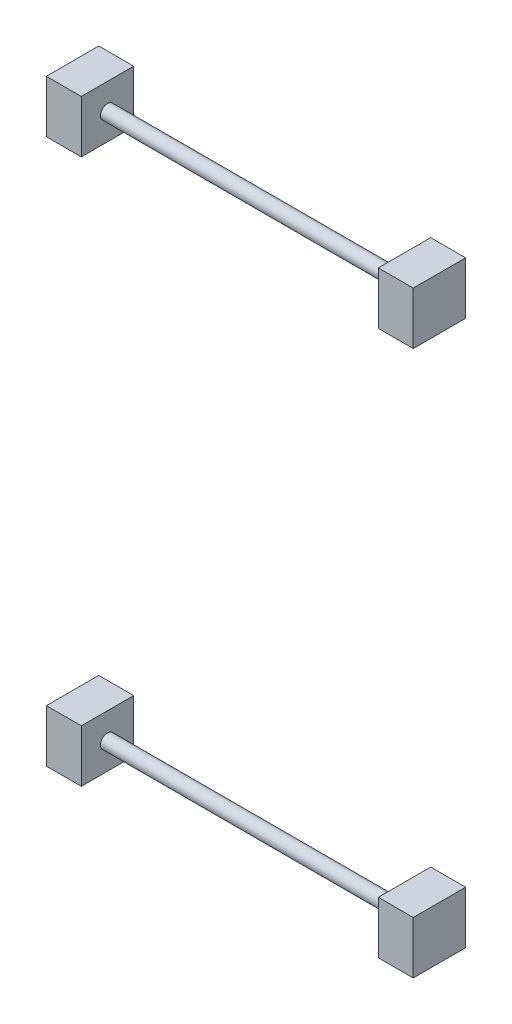
ISO-10303-21;
HEADER;
FILE_DESCRIPTION(('STEP AP214'),'2;1');
FILE_NAME('part.step','',(''),(''),'','','');
FILE_SCHEMA(('AUTOMOTIVE_DESIGN { 1 0 10303 214 1 1 1 1 }'));
ENDSEC;
DATA;
#1=APPLICATION_CONTEXT('core data for automotive mechanical design processes');
#2=APPLICATION_PROTOCOL_DEFINITION('international standard','automotive_design',2000,#1);
#3=PRODUCT_CONTEXT('',#1,'mechanical');
#4=PRODUCT('Part','Part','',(#3));
#5=PRODUCT_RELATED_PRODUCT_CATEGORY('part','',(#4));
#6=PRODUCT_DEFINITION_FORMATION('','',#4);
#7=PRODUCT_DEFINITION_CONTEXT('part definition',#1,'design');
#8=PRODUCT_DEFINITION('design','',#6,#7);
#9=PRODUCT_DEFINITION_SHAPE('','',#8);
#10=(LENGTH_UNIT() NAMED_UNIT(*) SI_UNIT(.MILLI.,.METRE.));
#11=(NAMED_UNIT(*) PLANE_ANGLE_UNIT() SI_UNIT($,.RADIAN.));
#12=(NAMED_UNIT(*) SI_UNIT($,.STERADIAN.) SOLID_ANGLE_UNIT());
#13=UNCERTAINTY_MEASURE_WITH_UNIT(LENGTH_MEASURE(1.E-05),#10,'distance_accuracy_value','');
#14=(GEOMETRIC_REPRESENTATION_CONTEXT(3) GLOBAL_UNCERTAINTY_ASSIGNED_CONTEXT((#13)) GLOBAL_UNIT_ASSIGNED_CONTEXT((#10,
#11,#12)) REPRESENTATION_CONTEXT('',''));
#15=CARTESIAN_POINT('',(0.,0.,0.));
#16=DIRECTION('',(0.,0.,1.));
#17=DIRECTION('',(1.,0.,0.));
#18=AXIS2_PLACEMENT_3D('',#15,#16,#17);
#19=CARTESIAN_POINT('',(-23425.5611417375,6354.66669336816,40692.8588324336));
#20=DIRECTION('',(0.,0.,1.));
#21=DIRECTION('',(1.,0.,0.));
#22=AXIS2_PLACEMENT_3D('',#19,#20,#21);
#23=PLANE('',#22);
#24=DIRECTION('',(0.,1.,0.));
#25=VECTOR('',#24,1.);
#26=CARTESIAN_POINT('',(-23475.5611417375,6354.66669336816,40692.8588324336));
#27=LINE('',#26,#25);
#28=CARTESIAN_POINT('',(-23475.5611417375,6354.66669336816,40692.8588324336));
#29=VERTEX_POINT('',#28);
#30=CARTESIAN_POINT('',(-23475.5611417375,6429.6666933681,40692.8588324336));
#31=VERTEX_POINT('',#30);
#32=EDGE_CURVE('E167',#29,#31,#27,.T.);
#33=ORIENTED_EDGE('',*,*,#32,.F.);
#34=DIRECTION('',(-1.,0.,0.));
#35=VECTOR('',#34,1.);
#36=CARTESIAN_POINT('',(-23425.5611417375,6354.66669336816,40692.8588324336));
#37=LINE('',#36,#35);
#38=CARTESIAN_POINT('',(-23425.5611417375,6354.66669336816,40692.8588324336));
#39=VERTEX_POINT('',#38);
#40=EDGE_CURVE('E57',#39,#29,#37,.T.);
#41=ORIENTED_EDGE('',*,*,#40,.F.);
#42=DIRECTION('',(0.,1.,0.));
#43=VECTOR('',#42,1.);
#44=CARTESIAN_POINT('',(-23425.5611417375,6354.66669336816,40692.8588324336));
#45=LINE('',#44,#43);
#46=CARTESIAN_POINT('',(-23425.5611417375,6429.6666933681,40692.8588324336));
#47=VERTEX_POINT('',#46);
#48=EDGE_CURVE('E168',#39,#47,#45,.T.);
#49=ORIENTED_EDGE('',*,*,#48,.T.);
#50=DIRECTION('',(-1.,0.,0.));
#51=VECTOR('',#50,1.);
#52=CARTESIAN_POINT('',(-23425.5611417375,6429.6666933681,40692.8588324336));
#53=LINE('',#52,#51);
#54=EDGE_CURVE('E93',#47,#31,#53,.T.);
#55=ORIENTED_EDGE('',*,*,#54,.T.);
#56=EDGE_LOOP('',(#33,#41,#49,#55));
#57=FACE_BOUND('',#56,.T.);
#58=ADVANCED_FACE('F49',(#57),#23,.T.);
#59=CARTESIAN_POINT('',(-23425.5611417375,6354.66669336816,40692.8588324336));
#60=DIRECTION('',(0.,-1.,8.7633604077084E-13));
#61=DIRECTION('',(0.,-8.7633604077084E-13,-1.));
#62=AXIS2_PLACEMENT_3D('',#59,#60,#61);
#63=PLANE('',#62);
#64=DIRECTION('',(0.,8.7633604077084E-13,1.));
#65=VECTOR('',#64,1.);
#66=CARTESIAN_POINT('',(-23475.5611417375,6354.66669336816,40692.8588324336));
#67=LINE('',#66,#65);
#68=CARTESIAN_POINT('',(-23475.5611417375,6354.6666933681,40617.8588324336));
#69=VERTEX_POINT('',#68);
#70=EDGE_CURVE('E171',#69,#29,#67,.T.);
#71=ORIENTED_EDGE('',*,*,#70,.F.);
#72=DIRECTION('',(-1.,0.,0.));
#73=VECTOR('',#72,1.);
#74=CARTESIAN_POINT('',(-23425.5611417375,6354.6666933681,40617.8588324336));
#75=LINE('',#74,#73);
#76=CARTESIAN_POINT('',(-23425.5611417375,6354.6666933681,40617.8588324336));
#77=VERTEX_POINT('',#76);
#78=EDGE_CURVE('E82',#77,#69,#75,.T.);
#79=ORIENTED_EDGE('',*,*,#78,.F.);
#80=DIRECTION('',(0.,8.7633604077084E-13,1.));
#81=VECTOR('',#80,1.);
#82=CARTESIAN_POINT('',(-23425.5611417375,6354.66669336816,40692.8588324336));
#83=LINE('',#82,#81);
#84=EDGE_CURVE('E175',#77,#39,#83,.T.);
#85=ORIENTED_EDGE('',*,*,#84,.T.);
#86=ORIENTED_EDGE('',*,*,#40,.T.);
#87=EDGE_LOOP('',(#71,#79,#85,#86));
#88=FACE_BOUND('',#87,.T.);
#89=ADVANCED_FACE('F192',(#88),#63,.T.);
#90=CARTESIAN_POINT('',(-23425.5611417375,6354.6666933681,40617.8588324336));
#91=DIRECTION('',(0.,0.,-1.));
#92=DIRECTION('',(-1.,0.,0.));
#93=AXIS2_PLACEMENT_3D('',#90,#91,#92);
#94=PLANE('',#93);
#95=DIRECTION('',(0.,-1.,0.));
#96=VECTOR('',#95,1.);
#97=CARTESIAN_POINT('',(-23475.5611417375,6354.6666933681,40617.8588324336));
#98=LINE('',#97,#96);
#99=CARTESIAN_POINT('',(-23475.5611417375,6429.6666933681,40617.8588324336));
#100=VERTEX_POINT('',#99);
#101=EDGE_CURVE('E182',#100,#69,#98,.T.);
#102=ORIENTED_EDGE('',*,*,#101,.F.);
#103=DIRECTION('',(-1.,0.,0.));
#104=VECTOR('',#103,1.);
#105=CARTESIAN_POINT('',(-23425.5611417375,6429.6666933681,40617.8588324336));
#106=LINE('',#105,#104);
#107=CARTESIAN_POINT('',(-23425.5611417375,6429.6666933681,40617.8588324336));
#108=VERTEX_POINT('',#107);
#109=EDGE_CURVE('E188',#108,#100,#106,.T.);
#110=ORIENTED_EDGE('',*,*,#109,.F.);
#111=DIRECTION('',(0.,-1.,0.));
#112=VECTOR('',#111,1.);
#113=CARTESIAN_POINT('',(-23425.5611417375,6354.6666933681,40617.8588324336));
#114=LINE('',#113,#112);
#115=EDGE_CURVE('E173',#108,#77,#114,.T.);
#116=ORIENTED_EDGE('',*,*,#115,.T.);
#117=ORIENTED_EDGE('',*,*,#78,.T.);
#118=EDGE_LOOP('',(#102,#110,#116,#117));
#119=FACE_BOUND('',#118,.T.);
#120=ADVANCED_FACE('F195',(#119),#94,.T.);
#121=CARTESIAN_POINT('',(-23425.5611417375,6429.6666933681,40692.8588324336));
#122=DIRECTION('',(0.,1.,0.));
#123=DIRECTION('',(0.,0.,1.));
#124=AXIS2_PLACEMENT_3D('',#121,#122,#123);
#125=PLANE('',#124);
#126=DIRECTION('',(0.,0.,-1.));
#127=VECTOR('',#126,1.);
#128=CARTESIAN_POINT('',(-23475.5611417375,6429.6666933681,40692.8588324336));
#129=LINE('',#128,#127);
#130=EDGE_CURVE('E179',#31,#100,#129,.T.);
#131=ORIENTED_EDGE('',*,*,#130,.F.);
#132=ORIENTED_EDGE('',*,*,#54,.F.);
#133=DIRECTION('',(0.,0.,-1.));
#134=VECTOR('',#133,1.);
#135=CARTESIAN_POINT('',(-23425.5611417375,6429.6666933681,40692.8588324336));
#136=LINE('',#135,#134);
#137=EDGE_CURVE('E170',#47,#108,#136,.T.);
#138=ORIENTED_EDGE('',*,*,#137,.T.);
#139=ORIENTED_EDGE('',*,*,#109,.T.);
#140=EDGE_LOOP('',(#131,#132,#138,#139));
#141=FACE_BOUND('',#140,.T.);
#142=ADVANCED_FACE('F189',(#141),#125,.T.);
#143=CARTESIAN_POINT('',(-23425.5611417375,780.,0.));
#144=DIRECTION('',(-1.,0.,0.));
#145=DIRECTION('',(0.,0.,1.));
#146=AXIS2_PLACEMENT_3D('',#143,#144,#145);
#147=PLANE('',#146);
#148=CARTESIAN_POINT('',(-23425.5611417375,6392.1666933681,40655.3588324336));
#149=DIRECTION('',(-1.,0.,0.));
#150=DIRECTION('',(0.,0.,1.));
#151=AXIS2_PLACEMENT_3D('',#148,#149,#150);
#152=CIRCLE('',#151,10.0000000000004);
#153=CARTESIAN_POINT('',(-23425.5611417375,6392.1666933681,40665.3588324336));
#154=VERTEX_POINT('',#153);
#155=EDGE_CURVE('E161',#154,#154,#152,.T.);
#156=ORIENTED_EDGE('',*,*,#155,.T.);
#157=EDGE_LOOP('',(#156));
#158=FACE_BOUND('',#157,.T.);
#159=ORIENTED_EDGE('',*,*,#48,.F.);
#160=ORIENTED_EDGE('',*,*,#84,.F.);
#161=ORIENTED_EDGE('',*,*,#115,.F.);
#162=ORIENTED_EDGE('',*,*,#137,.F.);
#163=EDGE_LOOP('',(#159,#160,#161,#162));
#164=FACE_BOUND('',#163,.T.);
#165=ADVANCED_FACE('F197',(#158,#164),#147,.F.);
#166=CARTESIAN_POINT('',(-23475.5611417375,780.,0.));
#167=DIRECTION('',(-1.,0.,0.));
#168=DIRECTION('',(0.,0.,1.));
#169=AXIS2_PLACEMENT_3D('',#166,#167,#168);
#170=PLANE('',#169);
#171=ORIENTED_EDGE('',*,*,#32,.T.);
#172=ORIENTED_EDGE('',*,*,#130,.T.);
#173=ORIENTED_EDGE('',*,*,#101,.T.);
#174=ORIENTED_EDGE('',*,*,#70,.T.);
#175=EDGE_LOOP('',(#171,#172,#173,#174));
#176=FACE_BOUND('',#175,.T.);
#177=ADVANCED_FACE('F191',(#176),#170,.T.);
#178=CARTESIAN_POINT('',(-22950.5611417375,6392.1666933681,40655.3588324336));
#179=DIRECTION('',(-1.,0.,0.));
#180=DIRECTION('',(0.,0.,1.));
#181=AXIS2_PLACEMENT_3D('',#178,#179,#180);
#182=CYLINDRICAL_SURFACE('',#181,10.0000000000004);
#183=CARTESIAN_POINT('',(-23000.5611417375,6392.1666933681,40655.3588324336));
#184=DIRECTION('',(-1.,0.,0.));
#185=DIRECTION('',(0.,0.,1.));
#186=AXIS2_PLACEMENT_3D('',#183,#184,#185);
#187=CIRCLE('',#186,10.0000000000004);
#188=CARTESIAN_POINT('',(-23000.5611417375,6392.1666933681,40665.3588324336));
#189=VERTEX_POINT('',#188);
#190=EDGE_CURVE('E12',#189,#189,#187,.F.);
#191=ORIENTED_EDGE('',*,*,#190,.F.);
#192=EDGE_LOOP('',(#191));
#193=FACE_BOUND('',#192,.T.);
#194=ORIENTED_EDGE('',*,*,#155,.F.);
#195=EDGE_LOOP('',(#194));
#196=FACE_BOUND('',#195,.T.);
#197=ADVANCED_FACE('F205',(#193,#196),#182,.T.);
#198=CARTESIAN_POINT('',(-22950.5611417375,6354.66669336816,40692.8588324336));
#199=DIRECTION('',(0.,0.,1.));
#200=DIRECTION('',(1.,0.,0.));
#201=AXIS2_PLACEMENT_3D('',#198,#199,#200);
#202=PLANE('',#201);
#203=DIRECTION('',(0.,1.,0.));
#204=VECTOR('',#203,1.);
#205=CARTESIAN_POINT('',(-23000.5611417375,6354.66669336816,40692.8588324336));
#206=LINE('',#205,#204);
#207=CARTESIAN_POINT('',(-23000.5611417375,6354.66669336816,40692.8588324336));
#208=VERTEX_POINT('',#207);
#209=CARTESIAN_POINT('',(-23000.5611417375,6429.6666933681,40692.8588324336));
#210=VERTEX_POINT('',#209);
#211=EDGE_CURVE('E155',#208,#210,#206,.T.);
#212=ORIENTED_EDGE('',*,*,#211,.F.);
#213=DIRECTION('',(-1.,0.,0.));
#214=VECTOR('',#213,1.);
#215=CARTESIAN_POINT('',(-22950.5611417375,6354.66669336816,40692.8588324336));
#216=LINE('',#215,#214);
#217=CARTESIAN_POINT('',(-22950.5611417375,6354.66669336816,40692.8588324336));
#218=VERTEX_POINT('',#217);
#219=EDGE_CURVE('E146',#218,#208,#216,.T.);
#220=ORIENTED_EDGE('',*,*,#219,.F.);
#221=DIRECTION('',(0.,1.,0.));
#222=VECTOR('',#221,1.);
#223=CARTESIAN_POINT('',(-22950.5611417375,6354.66669336816,40692.8588324336));
#224=LINE('',#223,#222);
#225=CARTESIAN_POINT('',(-22950.5611417375,6429.6666933681,40692.8588324336));
#226=VERTEX_POINT('',#225);
#227=EDGE_CURVE('E140',#218,#226,#224,.T.);
#228=ORIENTED_EDGE('',*,*,#227,.T.);
#229=DIRECTION('',(-1.,0.,0.));
#230=VECTOR('',#229,1.);
#231=CARTESIAN_POINT('',(-22950.5611417375,6429.6666933681,40692.8588324336));
#232=LINE('',#231,#230);
#233=EDGE_CURVE('E122',#226,#210,#232,.T.);
#234=ORIENTED_EDGE('',*,*,#233,.T.);
#235=EDGE_LOOP('',(#212,#220,#228,#234));
#236=FACE_BOUND('',#235,.T.);
#237=ADVANCED_FACE('F145',(#236),#202,.T.);
#238=CARTESIAN_POINT('',(-22950.5611417375,6354.66669336816,40692.8588324336));
#239=DIRECTION('',(0.,-1.,8.7633604077084E-13));
#240=DIRECTION('',(0.,-8.7633604077084E-13,-1.));
#241=AXIS2_PLACEMENT_3D('',#238,#239,#240);
#242=PLANE('',#241);
#243=DIRECTION('',(0.,8.7633604077084E-13,1.));
#244=VECTOR('',#243,1.);
#245=CARTESIAN_POINT('',(-23000.5611417375,6354.66669336816,40692.8588324336));
#246=LINE('',#245,#244);
#247=CARTESIAN_POINT('',(-23000.5611417375,6354.6666933681,40617.8588324336));
#248=VERTEX_POINT('',#247);
#249=EDGE_CURVE('E147',#248,#208,#246,.T.);
#250=ORIENTED_EDGE('',*,*,#249,.F.);
#251=DIRECTION('',(-1.,0.,0.));
#252=VECTOR('',#251,1.);
#253=CARTESIAN_POINT('',(-22950.5611417375,6354.6666933681,40617.8588324336));
#254=LINE('',#253,#252);
#255=CARTESIAN_POINT('',(-22950.5611417375,6354.6666933681,40617.8588324336));
#256=VERTEX_POINT('',#255);
#257=EDGE_CURVE('E162',#256,#248,#254,.T.);
#258=ORIENTED_EDGE('',*,*,#257,.F.);
#259=DIRECTION('',(0.,8.7633604077084E-13,1.));
#260=VECTOR('',#259,1.);
#261=CARTESIAN_POINT('',(-22950.5611417375,6354.66669336816,40692.8588324336));
#262=LINE('',#261,#260);
#263=EDGE_CURVE('E133',#256,#218,#262,.T.);
#264=ORIENTED_EDGE('',*,*,#263,.T.);
#265=ORIENTED_EDGE('',*,*,#219,.T.);
#266=EDGE_LOOP('',(#250,#258,#264,#265));
#267=FACE_BOUND('',#266,.T.);
#268=ADVANCED_FACE('F255',(#267),#242,.T.);
#269=CARTESIAN_POINT('',(-22950.5611417375,6354.6666933681,40617.8588324336));
#270=DIRECTION('',(0.,0.,-1.));
#271=DIRECTION('',(-1.,0.,0.));
#272=AXIS2_PLACEMENT_3D('',#269,#270,#271);
#273=PLANE('',#272);
#274=DIRECTION('',(0.,-1.,0.));
#275=VECTOR('',#274,1.);
#276=CARTESIAN_POINT('',(-23000.5611417375,6354.6666933681,40617.8588324336));
#277=LINE('',#276,#275);
#278=CARTESIAN_POINT('',(-23000.5611417375,6429.6666933681,40617.8588324336));
#279=VERTEX_POINT('',#278);
#280=EDGE_CURVE('E150',#279,#248,#277,.T.);
#281=ORIENTED_EDGE('',*,*,#280,.F.);
#282=DIRECTION('',(-1.,0.,0.));
#283=VECTOR('',#282,1.);
#284=CARTESIAN_POINT('',(-22950.5611417375,6429.6666933681,40617.8588324336));
#285=LINE('',#284,#283);
#286=CARTESIAN_POINT('',(-22950.5611417375,6429.6666933681,40617.8588324336));
#287=VERTEX_POINT('',#286);
#288=EDGE_CURVE('E132',#287,#279,#285,.T.);
#289=ORIENTED_EDGE('',*,*,#288,.F.);
#290=DIRECTION('',(0.,-1.,0.));
#291=VECTOR('',#290,1.);
#292=CARTESIAN_POINT('',(-22950.5611417375,6354.6666933681,40617.8588324336));
#293=LINE('',#292,#291);
#294=EDGE_CURVE('E143',#287,#256,#293,.T.);
#295=ORIENTED_EDGE('',*,*,#294,.T.);
#296=ORIENTED_EDGE('',*,*,#257,.T.);
#297=EDGE_LOOP('',(#281,#289,#295,#296));
#298=FACE_BOUND('',#297,.T.);
#299=ADVANCED_FACE('F265',(#298),#273,.T.);
#300=CARTESIAN_POINT('',(-22950.5611417375,6429.6666933681,40692.8588324336));
#301=DIRECTION('',(0.,1.,0.));
#302=DIRECTION('',(0.,0.,1.));
#303=AXIS2_PLACEMENT_3D('',#300,#301,#302);
#304=PLANE('',#303);
#305=DIRECTION('',(0.,0.,-1.));
#306=VECTOR('',#305,1.);
#307=CARTESIAN_POINT('',(-23000.5611417375,6429.6666933681,40692.8588324336));
#308=LINE('',#307,#306);
#309=EDGE_CURVE('E127',#210,#279,#308,.T.);
#310=ORIENTED_EDGE('',*,*,#309,.F.);
#311=ORIENTED_EDGE('',*,*,#233,.F.);
#312=DIRECTION('',(0.,0.,-1.));
#313=VECTOR('',#312,1.);
#314=CARTESIAN_POINT('',(-22950.5611417375,6429.6666933681,40692.8588324336));
#315=LINE('',#314,#313);
#316=EDGE_CURVE('E125',#226,#287,#315,.T.);
#317=ORIENTED_EDGE('',*,*,#316,.T.);
#318=ORIENTED_EDGE('',*,*,#288,.T.);
#319=EDGE_LOOP('',(#310,#311,#317,#318));
#320=FACE_BOUND('',#319,.T.);
#321=ADVANCED_FACE('F124',(#320),#304,.T.);
#322=CARTESIAN_POINT('',(-23000.5611417375,780.,0.));
#323=DIRECTION('',(-1.,0.,0.));
#324=DIRECTION('',(0.,0.,1.));
#325=AXIS2_PLACEMENT_3D('',#322,#323,#324);
#326=PLANE('',#325);
#327=ORIENTED_EDGE('',*,*,#190,.T.);
#328=EDGE_LOOP('',(#327));
#329=FACE_BOUND('',#328,.T.);
#330=ORIENTED_EDGE('',*,*,#211,.T.);
#331=ORIENTED_EDGE('',*,*,#309,.T.);
#332=ORIENTED_EDGE('',*,*,#280,.T.);
#333=ORIENTED_EDGE('',*,*,#249,.T.);
#334=EDGE_LOOP('',(#330,#331,#332,#333));
#335=FACE_BOUND('',#334,.T.);
#336=ADVANCED_FACE('F286',(#329,#335),#326,.T.);
#337=CARTESIAN_POINT('',(-22950.5611417375,6392.1666933681,40655.3588324336));
#338=DIRECTION('',(-1.,0.,0.));
#339=DIRECTION('',(0.,0.,1.));
#340=AXIS2_PLACEMENT_3D('',#337,#338,#339);
#341=PLANE('',#340);
#342=ORIENTED_EDGE('',*,*,#227,.F.);
#343=ORIENTED_EDGE('',*,*,#263,.F.);
#344=ORIENTED_EDGE('',*,*,#294,.F.);
#345=ORIENTED_EDGE('',*,*,#316,.F.);
#346=EDGE_LOOP('',(#342,#343,#344,#345));
#347=FACE_BOUND('',#346,.T.);
#348=ADVANCED_FACE('F138',(#347),#341,.F.);
#349=CLOSED_SHELL('',(#58,#89,#120,#142,#165,#177,#197,#237,#268,#299,#321,#336,#348));
#350=MANIFOLD_SOLID_BREP('B2',#349);
#351=CARTESIAN_POINT('',(-23425.5611417375,5574.66669336816,40692.8588324336));
#352=DIRECTION('',(0.,0.,1.));
#353=DIRECTION('',(1.,0.,0.));
#354=AXIS2_PLACEMENT_3D('',#351,#352,#353);
#355=PLANE('',#354);
#356=DIRECTION('',(0.,1.,0.));
#357=VECTOR('',#356,1.);
#358=CARTESIAN_POINT('',(-23475.5611417375,5574.66669336816,40692.8588324336));
#359=LINE('',#358,#357);
#360=CARTESIAN_POINT('',(-23475.5611417375,5574.66669336816,40692.8588324336));
#361=VERTEX_POINT('',#360);
#362=CARTESIAN_POINT('',(-23475.5611417375,5649.6666933681,40692.8588324336));
#363=VERTEX_POINT('',#362);
#364=EDGE_CURVE('E470',#361,#363,#359,.T.);
#365=ORIENTED_EDGE('',*,*,#364,.F.);
#366=DIRECTION('',(-1.,0.,0.));
#367=VECTOR('',#366,1.);
#368=CARTESIAN_POINT('',(-23425.5611417375,5574.66669336816,40692.8588324336));
#369=LINE('',#368,#367);
#370=CARTESIAN_POINT('',(-23425.5611417375,5574.66669336816,40692.8588324336));
#371=VERTEX_POINT('',#370);
#372=EDGE_CURVE('E360',#371,#361,#369,.T.);
#373=ORIENTED_EDGE('',*,*,#372,.F.);
#374=DIRECTION('',(0.,1.,0.));
#375=VECTOR('',#374,1.);
#376=CARTESIAN_POINT('',(-23425.5611417375,5574.66669336816,40692.8588324336));
#377=LINE('',#376,#375);
#378=CARTESIAN_POINT('',(-23425.5611417375,5649.6666933681,40692.8588324336));
#379=VERTEX_POINT('',#378);
#380=EDGE_CURVE('E471',#371,#379,#377,.T.);
#381=ORIENTED_EDGE('',*,*,#380,.T.);
#382=DIRECTION('',(-1.,0.,0.));
#383=VECTOR('',#382,1.);
#384=CARTESIAN_POINT('',(-23425.5611417375,5649.6666933681,40692.8588324336));
#385=LINE('',#384,#383);
#386=EDGE_CURVE('E396',#379,#363,#385,.T.);
#387=ORIENTED_EDGE('',*,*,#386,.T.);
#388=EDGE_LOOP('',(#365,#373,#381,#387));
#389=FACE_BOUND('',#388,.T.);
#390=ADVANCED_FACE('F352',(#389),#355,.T.);
#391=CARTESIAN_POINT('',(-23425.5611417375,5574.66669336816,40692.8588324336));
#392=DIRECTION('',(0.,-1.,8.7633604077084E-13));
#393=DIRECTION('',(0.,-8.7633604077084E-13,-1.));
#394=AXIS2_PLACEMENT_3D('',#391,#392,#393);
#395=PLANE('',#394);
#396=DIRECTION('',(0.,8.7633604077084E-13,1.));
#397=VECTOR('',#396,1.);
#398=CARTESIAN_POINT('',(-23475.5611417375,5574.66669336816,40692.8588324336));
#399=LINE('',#398,#397);
#400=CARTESIAN_POINT('',(-23475.5611417375,5574.6666933681,40617.8588324336));
#401=VERTEX_POINT('',#400);
#402=EDGE_CURVE('E474',#401,#361,#399,.T.);
#403=ORIENTED_EDGE('',*,*,#402,.F.);
#404=DIRECTION('',(-1.,0.,0.));
#405=VECTOR('',#404,1.);
#406=CARTESIAN_POINT('',(-23425.5611417375,5574.6666933681,40617.8588324336));
#407=LINE('',#406,#405);
#408=CARTESIAN_POINT('',(-23425.5611417375,5574.6666933681,40617.8588324336));
#409=VERTEX_POINT('',#408);
#410=EDGE_CURVE('E385',#409,#401,#407,.T.);
#411=ORIENTED_EDGE('',*,*,#410,.F.);
#412=DIRECTION('',(0.,8.7633604077084E-13,1.));
#413=VECTOR('',#412,1.);
#414=CARTESIAN_POINT('',(-23425.5611417375,5574.66669336816,40692.8588324336));
#415=LINE('',#414,#413);
#416=EDGE_CURVE('E478',#409,#371,#415,.T.);
#417=ORIENTED_EDGE('',*,*,#416,.T.);
#418=ORIENTED_EDGE('',*,*,#372,.T.);
#419=EDGE_LOOP('',(#403,#411,#417,#418));
#420=FACE_BOUND('',#419,.T.);
#421=ADVANCED_FACE('F495',(#420),#395,.T.);
#422=CARTESIAN_POINT('',(-23425.5611417375,5574.6666933681,40617.8588324336));
#423=DIRECTION('',(0.,0.,-1.));
#424=DIRECTION('',(-1.,0.,0.));
#425=AXIS2_PLACEMENT_3D('',#422,#423,#424);
#426=PLANE('',#425);
#427=DIRECTION('',(0.,-1.,0.));
#428=VECTOR('',#427,1.);
#429=CARTESIAN_POINT('',(-23475.5611417375,5574.6666933681,40617.8588324336));
#430=LINE('',#429,#428);
#431=CARTESIAN_POINT('',(-23475.5611417375,5649.6666933681,40617.8588324336));
#432=VERTEX_POINT('',#431);
#433=EDGE_CURVE('E485',#432,#401,#430,.T.);
#434=ORIENTED_EDGE('',*,*,#433,.F.);
#435=DIRECTION('',(-1.,0.,0.));
#436=VECTOR('',#435,1.);
#437=CARTESIAN_POINT('',(-23425.5611417375,5649.6666933681,40617.8588324336));
#438=LINE('',#437,#436);
#439=CARTESIAN_POINT('',(-23425.5611417375,5649.6666933681,40617.8588324336));
#440=VERTEX_POINT('',#439);
#441=EDGE_CURVE('E491',#440,#432,#438,.T.);
#442=ORIENTED_EDGE('',*,*,#441,.F.);
#443=DIRECTION('',(0.,-1.,0.));
#444=VECTOR('',#443,1.);
#445=CARTESIAN_POINT('',(-23425.5611417375,5574.6666933681,40617.8588324336));
#446=LINE('',#445,#444);
#447=EDGE_CURVE('E476',#440,#409,#446,.T.);
#448=ORIENTED_EDGE('',*,*,#447,.T.);
#449=ORIENTED_EDGE('',*,*,#410,.T.);
#450=EDGE_LOOP('',(#434,#442,#448,#449));
#451=FACE_BOUND('',#450,.T.);
#452=ADVANCED_FACE('F498',(#451),#426,.T.);
#453=CARTESIAN_POINT('',(-23425.5611417375,5649.6666933681,40692.8588324336));
#454=DIRECTION('',(0.,1.,0.));
#455=DIRECTION('',(0.,0.,1.));
#456=AXIS2_PLACEMENT_3D('',#453,#454,#455);
#457=PLANE('',#456);
#458=DIRECTION('',(0.,0.,-1.));
#459=VECTOR('',#458,1.);
#460=CARTESIAN_POINT('',(-23475.5611417375,5649.6666933681,40692.8588324336));
#461=LINE('',#460,#459);
#462=EDGE_CURVE('E482',#363,#432,#461,.T.);
#463=ORIENTED_EDGE('',*,*,#462,.F.);
#464=ORIENTED_EDGE('',*,*,#386,.F.);
#465=DIRECTION('',(0.,0.,-1.));
#466=VECTOR('',#465,1.);
#467=CARTESIAN_POINT('',(-23425.5611417375,5649.6666933681,40692.8588324336));
#468=LINE('',#467,#466);
#469=EDGE_CURVE('E473',#379,#440,#468,.T.);
#470=ORIENTED_EDGE('',*,*,#469,.T.);
#471=ORIENTED_EDGE('',*,*,#441,.T.);
#472=EDGE_LOOP('',(#463,#464,#470,#471));
#473=FACE_BOUND('',#472,.T.);
#474=ADVANCED_FACE('F492',(#473),#457,.T.);
#475=CARTESIAN_POINT('',(-23425.5611417375,0.,0.));
#476=DIRECTION('',(-1.,0.,0.));
#477=DIRECTION('',(0.,0.,1.));
#478=AXIS2_PLACEMENT_3D('',#475,#476,#477);
#479=PLANE('',#478);
#480=CARTESIAN_POINT('',(-23425.5611417375,5612.1666933681,40655.3588324336));
#481=DIRECTION('',(-1.,0.,0.));
#482=DIRECTION('',(0.,0.,1.));
#483=AXIS2_PLACEMENT_3D('',#480,#481,#482);
#484=CIRCLE('',#483,10.0000000000004);
#485=CARTESIAN_POINT('',(-23425.5611417375,5612.1666933681,40665.3588324336));
#486=VERTEX_POINT('',#485);
#487=EDGE_CURVE('E464',#486,#486,#484,.T.);
#488=ORIENTED_EDGE('',*,*,#487,.T.);
#489=EDGE_LOOP('',(#488));
#490=FACE_BOUND('',#489,.T.);
#491=ORIENTED_EDGE('',*,*,#380,.F.);
#492=ORIENTED_EDGE('',*,*,#416,.F.);
#493=ORIENTED_EDGE('',*,*,#447,.F.);
#494=ORIENTED_EDGE('',*,*,#469,.F.);
#495=EDGE_LOOP('',(#491,#492,#493,#494));
#496=FACE_BOUND('',#495,.T.);
#497=ADVANCED_FACE('F500',(#490,#496),#479,.F.);
#498=CARTESIAN_POINT('',(-23475.5611417375,0.,0.));
#499=DIRECTION('',(-1.,0.,0.));
#500=DIRECTION('',(0.,0.,1.));
#501=AXIS2_PLACEMENT_3D('',#498,#499,#500);
#502=PLANE('',#501);
#503=ORIENTED_EDGE('',*,*,#364,.T.);
#504=ORIENTED_EDGE('',*,*,#462,.T.);
#505=ORIENTED_EDGE('',*,*,#433,.T.);
#506=ORIENTED_EDGE('',*,*,#402,.T.);
#507=EDGE_LOOP('',(#503,#504,#505,#506));
#508=FACE_BOUND('',#507,.T.);
#509=ADVANCED_FACE('F494',(#508),#502,.T.);
#510=CARTESIAN_POINT('',(-22950.5611417375,5612.1666933681,40655.3588324336));
#511=DIRECTION('',(-1.,0.,0.));
#512=DIRECTION('',(0.,0.,1.));
#513=AXIS2_PLACEMENT_3D('',#510,#511,#512);
#514=CYLINDRICAL_SURFACE('',#513,10.0000000000004);
#515=CARTESIAN_POINT('',(-23000.5611417375,5612.1666933681,40655.3588324336));
#516=DIRECTION('',(-1.,0.,0.));
#517=DIRECTION('',(0.,0.,1.));
#518=AXIS2_PLACEMENT_3D('',#515,#516,#517);
#519=CIRCLE('',#518,10.0000000000004);
#520=CARTESIAN_POINT('',(-23000.5611417375,5612.1666933681,40665.3588324336));
#521=VERTEX_POINT('',#520);
#522=EDGE_CURVE('E47',#521,#521,#519,.F.);
#523=ORIENTED_EDGE('',*,*,#522,.F.);
#524=EDGE_LOOP('',(#523));
#525=FACE_BOUND('',#524,.T.);
#526=ORIENTED_EDGE('',*,*,#487,.F.);
#527=EDGE_LOOP('',(#526));
#528=FACE_BOUND('',#527,.T.);
#529=ADVANCED_FACE('F508',(#525,#528),#514,.T.);
#530=CARTESIAN_POINT('',(-22950.5611417375,5574.66669336816,40692.8588324336));
#531=DIRECTION('',(0.,0.,1.));
#532=DIRECTION('',(1.,0.,0.));
#533=AXIS2_PLACEMENT_3D('',#530,#531,#532);
#534=PLANE('',#533);
#535=DIRECTION('',(0.,1.,0.));
#536=VECTOR('',#535,1.);
#537=CARTESIAN_POINT('',(-23000.5611417375,5574.66669336816,40692.8588324336));
#538=LINE('',#537,#536);
#539=CARTESIAN_POINT('',(-23000.5611417375,5574.66669336816,40692.8588324336));
#540=VERTEX_POINT('',#539);
#541=CARTESIAN_POINT('',(-23000.5611417375,5649.6666933681,40692.8588324336));
#542=VERTEX_POINT('',#541);
#543=EDGE_CURVE('E458',#540,#542,#538,.T.);
#544=ORIENTED_EDGE('',*,*,#543,.F.);
#545=DIRECTION('',(-1.,0.,0.));
#546=VECTOR('',#545,1.);
#547=CARTESIAN_POINT('',(-22950.5611417375,5574.66669336816,40692.8588324336));
#548=LINE('',#547,#546);
#549=CARTESIAN_POINT('',(-22950.5611417375,5574.66669336816,40692.8588324336));
#550=VERTEX_POINT('',#549);
#551=EDGE_CURVE('E449',#550,#540,#548,.T.);
#552=ORIENTED_EDGE('',*,*,#551,.F.);
#553=DIRECTION('',(0.,1.,0.));
#554=VECTOR('',#553,1.);
#555=CARTESIAN_POINT('',(-22950.5611417375,5574.66669336816,40692.8588324336));
#556=LINE('',#555,#554);
#557=CARTESIAN_POINT('',(-22950.5611417375,5649.6666933681,40692.8588324336));
#558=VERTEX_POINT('',#557);
#559=EDGE_CURVE('E443',#550,#558,#556,.T.);
#560=ORIENTED_EDGE('',*,*,#559,.T.);
#561=DIRECTION('',(-1.,0.,0.));
#562=VECTOR('',#561,1.);
#563=CARTESIAN_POINT('',(-22950.5611417375,5649.6666933681,40692.8588324336));
#564=LINE('',#563,#562);
#565=EDGE_CURVE('E425',#558,#542,#564,.T.);
#566=ORIENTED_EDGE('',*,*,#565,.T.);
#567=EDGE_LOOP('',(#544,#552,#560,#566));
#568=FACE_BOUND('',#567,.T.);
#569=ADVANCED_FACE('F448',(#568),#534,.T.);
#570=CARTESIAN_POINT('',(-22950.5611417375,5574.66669336816,40692.8588324336));
#571=DIRECTION('',(0.,-1.,8.7633604077084E-13));
#572=DIRECTION('',(0.,-8.7633604077084E-13,-1.));
#573=AXIS2_PLACEMENT_3D('',#570,#571,#572);
#574=PLANE('',#573);
#575=DIRECTION('',(0.,8.7633604077084E-13,1.));
#576=VECTOR('',#575,1.);
#577=CARTESIAN_POINT('',(-23000.5611417375,5574.66669336816,40692.8588324336));
#578=LINE('',#577,#576);
#579=CARTESIAN_POINT('',(-23000.5611417375,5574.6666933681,40617.8588324336));
#580=VERTEX_POINT('',#579);
#581=EDGE_CURVE('E450',#580,#540,#578,.T.);
#582=ORIENTED_EDGE('',*,*,#581,.F.);
#583=DIRECTION('',(-1.,0.,0.));
#584=VECTOR('',#583,1.);
#585=CARTESIAN_POINT('',(-22950.5611417375,5574.6666933681,40617.8588324336));
#586=LINE('',#585,#584);
#587=CARTESIAN_POINT('',(-22950.5611417375,5574.6666933681,40617.8588324336));
#588=VERTEX_POINT('',#587);
#589=EDGE_CURVE('E465',#588,#580,#586,.T.);
#590=ORIENTED_EDGE('',*,*,#589,.F.);
#591=DIRECTION('',(0.,8.7633604077084E-13,1.));
#592=VECTOR('',#591,1.);
#593=CARTESIAN_POINT('',(-22950.5611417375,5574.66669336816,40692.8588324336));
#594=LINE('',#593,#592);
#595=EDGE_CURVE('E436',#588,#550,#594,.T.);
#596=ORIENTED_EDGE('',*,*,#595,.T.);
#597=ORIENTED_EDGE('',*,*,#551,.T.);
#598=EDGE_LOOP('',(#582,#590,#596,#597));
#599=FACE_BOUND('',#598,.T.);
#600=ADVANCED_FACE('F560',(#599),#574,.T.);
#601=CARTESIAN_POINT('',(-22950.5611417375,5574.6666933681,40617.8588324336));
#602=DIRECTION('',(0.,0.,-1.));
#603=DIRECTION('',(-1.,0.,0.));
#604=AXIS2_PLACEMENT_3D('',#601,#602,#603);
#605=PLANE('',#604);
#606=DIRECTION('',(0.,-1.,0.));
#607=VECTOR('',#606,1.);
#608=CARTESIAN_POINT('',(-23000.5611417375,5574.6666933681,40617.8588324336));
#609=LINE('',#608,#607);
#610=CARTESIAN_POINT('',(-23000.5611417375,5649.6666933681,40617.8588324336));
#611=VERTEX_POINT('',#610);
#612=EDGE_CURVE('E453',#611,#580,#609,.T.);
#613=ORIENTED_EDGE('',*,*,#612,.F.);
#614=DIRECTION('',(-1.,0.,0.));
#615=VECTOR('',#614,1.);
#616=CARTESIAN_POINT('',(-22950.5611417375,5649.6666933681,40617.8588324336));
#617=LINE('',#616,#615);
#618=CARTESIAN_POINT('',(-22950.5611417375,5649.6666933681,40617.8588324336));
#619=VERTEX_POINT('',#618);
#620=EDGE_CURVE('E435',#619,#611,#617,.T.);
#621=ORIENTED_EDGE('',*,*,#620,.F.);
#622=DIRECTION('',(0.,-1.,0.));
#623=VECTOR('',#622,1.);
#624=CARTESIAN_POINT('',(-22950.5611417375,5574.6666933681,40617.8588324336));
#625=LINE('',#624,#623);
#626=EDGE_CURVE('E446',#619,#588,#625,.T.);
#627=ORIENTED_EDGE('',*,*,#626,.T.);
#628=ORIENTED_EDGE('',*,*,#589,.T.);
#629=EDGE_LOOP('',(#613,#621,#627,#628));
#630=FACE_BOUND('',#629,.T.);
#631=ADVANCED_FACE('F570',(#630),#605,.T.);
#632=CARTESIAN_POINT('',(-22950.5611417375,5649.6666933681,40692.8588324336));
#633=DIRECTION('',(0.,1.,0.));
#634=DIRECTION('',(0.,0.,1.));
#635=AXIS2_PLACEMENT_3D('',#632,#633,#634);
#636=PLANE('',#635);
#637=DIRECTION('',(0.,0.,-1.));
#638=VECTOR('',#637,1.);
#639=CARTESIAN_POINT('',(-23000.5611417375,5649.6666933681,40692.8588324336));
#640=LINE('',#639,#638);
#641=EDGE_CURVE('E430',#542,#611,#640,.T.);
#642=ORIENTED_EDGE('',*,*,#641,.F.);
#643=ORIENTED_EDGE('',*,*,#565,.F.);
#644=DIRECTION('',(0.,0.,-1.));
#645=VECTOR('',#644,1.);
#646=CARTESIAN_POINT('',(-22950.5611417375,5649.6666933681,40692.8588324336));
#647=LINE('',#646,#645);
#648=EDGE_CURVE('E428',#558,#619,#647,.T.);
#649=ORIENTED_EDGE('',*,*,#648,.T.);
#650=ORIENTED_EDGE('',*,*,#620,.T.);
#651=EDGE_LOOP('',(#642,#643,#649,#650));
#652=FACE_BOUND('',#651,.T.);
#653=ADVANCED_FACE('F427',(#652),#636,.T.);
#654=CARTESIAN_POINT('',(-23000.5611417375,0.,0.));
#655=DIRECTION('',(-1.,0.,0.));
#656=DIRECTION('',(0.,0.,1.));
#657=AXIS2_PLACEMENT_3D('',#654,#655,#656);
#658=PLANE('',#657);
#659=ORIENTED_EDGE('',*,*,#522,.T.);
#660=EDGE_LOOP('',(#659));
#661=FACE_BOUND('',#660,.T.);
#662=ORIENTED_EDGE('',*,*,#543,.T.);
#663=ORIENTED_EDGE('',*,*,#641,.T.);
#664=ORIENTED_EDGE('',*,*,#612,.T.);
#665=ORIENTED_EDGE('',*,*,#581,.T.);
#666=EDGE_LOOP('',(#662,#663,#664,#665));
#667=FACE_BOUND('',#666,.T.);
#668=ADVANCED_FACE('F589',(#661,#667),#658,.T.);
#669=CARTESIAN_POINT('',(-22950.5611417375,5612.1666933681,40655.3588324336));
#670=DIRECTION('',(-1.,0.,0.));
#671=DIRECTION('',(0.,0.,1.));
#672=AXIS2_PLACEMENT_3D('',#669,#670,#671);
#673=PLANE('',#672);
#674=ORIENTED_EDGE('',*,*,#559,.F.);
#675=ORIENTED_EDGE('',*,*,#595,.F.);
#676=ORIENTED_EDGE('',*,*,#626,.F.);
#677=ORIENTED_EDGE('',*,*,#648,.F.);
#678=EDGE_LOOP('',(#674,#675,#676,#677));
#679=FACE_BOUND('',#678,.T.);
#680=ADVANCED_FACE('F441',(#679),#673,.F.);
#681=CLOSED_SHELL('',(#390,#421,#452,#474,#497,#509,#529,#569,#600,#631,#653,#668,#680));
#682=MANIFOLD_SOLID_BREP('B6',#681);
#683=ADVANCED_BREP_SHAPE_REPRESENTATION('',(#18,#350,#682),#14);
#684=SHAPE_DEFINITION_REPRESENTATION(#9,#683);
ENDSEC;
END-ISO-10303-21;
